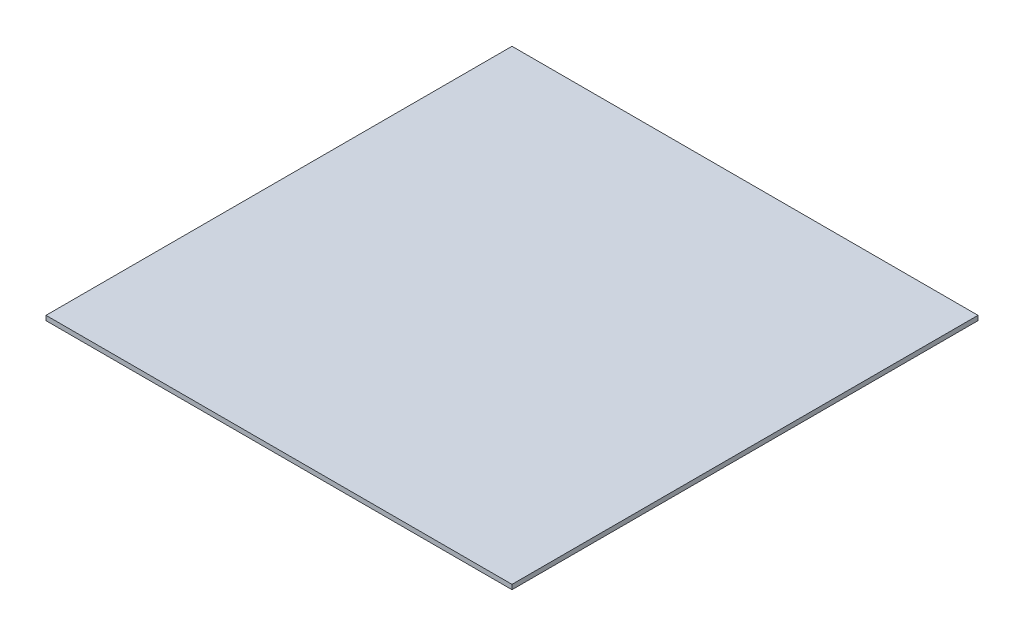
ISO-10303-21;
HEADER;
FILE_DESCRIPTION(('STEP AP214'),'2;1');
FILE_NAME('part.step','',(''),(''),'','','');
FILE_SCHEMA(('AUTOMOTIVE_DESIGN { 1 0 10303 214 1 1 1 1 }'));
ENDSEC;
DATA;
#1=APPLICATION_CONTEXT('core data for automotive mechanical design processes');
#2=APPLICATION_PROTOCOL_DEFINITION('international standard','automotive_design',2000,#1);
#3=PRODUCT_CONTEXT('',#1,'mechanical');
#4=PRODUCT('Part','Part','',(#3));
#5=PRODUCT_RELATED_PRODUCT_CATEGORY('part','',(#4));
#6=PRODUCT_DEFINITION_FORMATION('','',#4);
#7=PRODUCT_DEFINITION_CONTEXT('part definition',#1,'design');
#8=PRODUCT_DEFINITION('design','',#6,#7);
#9=PRODUCT_DEFINITION_SHAPE('','',#8);
#10=(LENGTH_UNIT() NAMED_UNIT(*) SI_UNIT(.MILLI.,.METRE.));
#11=(NAMED_UNIT(*) PLANE_ANGLE_UNIT() SI_UNIT($,.RADIAN.));
#12=(NAMED_UNIT(*) SI_UNIT($,.STERADIAN.) SOLID_ANGLE_UNIT());
#13=UNCERTAINTY_MEASURE_WITH_UNIT(LENGTH_MEASURE(1.E-05),#10,'distance_accuracy_value','');
#14=(GEOMETRIC_REPRESENTATION_CONTEXT(3) GLOBAL_UNCERTAINTY_ASSIGNED_CONTEXT((#13)) GLOBAL_UNIT_ASSIGNED_CONTEXT((#10,
#11,#12)) REPRESENTATION_CONTEXT('',''));
#15=CARTESIAN_POINT('',(0.,0.,0.));
#16=DIRECTION('',(0.,0.,1.));
#17=DIRECTION('',(1.,0.,0.));
#18=AXIS2_PLACEMENT_3D('',#15,#16,#17);
#19=CARTESIAN_POINT('',(-193.816556055352,2.,-50.20326159611));
#20=DIRECTION('',(1.,0.,0.));
#21=DIRECTION('',(0.,0.,-1.));
#22=AXIS2_PLACEMENT_3D('',#19,#20,#21);
#23=PLANE('',#22);
#24=DIRECTION('',(0.,0.,1.));
#25=VECTOR('',#24,1.);
#26=CARTESIAN_POINT('',(-193.816556055352,0.,-50.20326159611));
#27=LINE('',#26,#25);
#28=CARTESIAN_POINT('',(-193.816556055352,0.,-50.20326159611));
#29=VERTEX_POINT('',#28);
#30=CARTESIAN_POINT('',(-193.816556055352,0.,149.79673840389));
#31=VERTEX_POINT('',#30);
#32=EDGE_CURVE('E107',#29,#31,#27,.T.);
#33=ORIENTED_EDGE('',*,*,#32,.T.);
#34=DIRECTION('',(0.,-1.,0.));
#35=VECTOR('',#34,1.);
#36=CARTESIAN_POINT('',(-193.816556055352,2.,149.79673840389));
#37=LINE('',#36,#35);
#38=CARTESIAN_POINT('',(-193.816556055352,2.,149.79673840389));
#39=VERTEX_POINT('',#38);
#40=EDGE_CURVE('E11',#39,#31,#37,.T.);
#41=ORIENTED_EDGE('',*,*,#40,.F.);
#42=DIRECTION('',(0.,0.,1.));
#43=VECTOR('',#42,1.);
#44=CARTESIAN_POINT('',(-193.816556055352,2.,-50.20326159611));
#45=LINE('',#44,#43);
#46=CARTESIAN_POINT('',(-193.816556055352,2.,-50.20326159611));
#47=VERTEX_POINT('',#46);
#48=EDGE_CURVE('E91',#47,#39,#45,.T.);
#49=ORIENTED_EDGE('',*,*,#48,.F.);
#50=DIRECTION('',(0.,-1.,0.));
#51=VECTOR('',#50,1.);
#52=CARTESIAN_POINT('',(-193.816556055352,2.,-50.20326159611));
#53=LINE('',#52,#51);
#54=EDGE_CURVE('E103',#47,#29,#53,.T.);
#55=ORIENTED_EDGE('',*,*,#54,.T.);
#56=EDGE_LOOP('',(#33,#41,#49,#55));
#57=FACE_BOUND('',#56,.T.);
#58=ADVANCED_FACE('F39',(#57),#23,.F.);
#59=CARTESIAN_POINT('',(-193.816556055352,2.,149.79673840389));
#60=DIRECTION('',(0.,0.,-1.));
#61=DIRECTION('',(-1.,0.,0.));
#62=AXIS2_PLACEMENT_3D('',#59,#60,#61);
#63=PLANE('',#62);
#64=DIRECTION('',(1.,0.,0.));
#65=VECTOR('',#64,1.);
#66=CARTESIAN_POINT('',(-193.816556055352,0.,149.79673840389));
#67=LINE('',#66,#65);
#68=CARTESIAN_POINT('',(6.18344394464807,0.,149.79673840389));
#69=VERTEX_POINT('',#68);
#70=EDGE_CURVE('E96',#31,#69,#67,.T.);
#71=ORIENTED_EDGE('',*,*,#70,.T.);
#72=DIRECTION('',(0.,-1.,0.));
#73=VECTOR('',#72,1.);
#74=CARTESIAN_POINT('',(6.18344394464807,2.,149.79673840389));
#75=LINE('',#74,#73);
#76=CARTESIAN_POINT('',(6.18344394464807,2.,149.79673840389));
#77=VERTEX_POINT('',#76);
#78=EDGE_CURVE('E48',#77,#69,#75,.T.);
#79=ORIENTED_EDGE('',*,*,#78,.F.);
#80=DIRECTION('',(1.,0.,0.));
#81=VECTOR('',#80,1.);
#82=CARTESIAN_POINT('',(-193.816556055352,2.,149.79673840389));
#83=LINE('',#82,#81);
#84=EDGE_CURVE('E86',#39,#77,#83,.T.);
#85=ORIENTED_EDGE('',*,*,#84,.F.);
#86=ORIENTED_EDGE('',*,*,#40,.T.);
#87=EDGE_LOOP('',(#71,#79,#85,#86));
#88=FACE_BOUND('',#87,.T.);
#89=ADVANCED_FACE('F95',(#88),#63,.F.);
#90=CARTESIAN_POINT('',(6.18344394464805,2.,-50.20326159611));
#91=DIRECTION('',(-1.,0.,0.));
#92=DIRECTION('',(0.,0.,1.));
#93=AXIS2_PLACEMENT_3D('',#90,#91,#92);
#94=PLANE('',#93);
#95=DIRECTION('',(0.,0.,-1.));
#96=VECTOR('',#95,1.);
#97=CARTESIAN_POINT('',(6.18344394464805,0.,-50.20326159611));
#98=LINE('',#97,#96);
#99=CARTESIAN_POINT('',(6.18344394464805,0.,-50.20326159611));
#100=VERTEX_POINT('',#99);
#101=EDGE_CURVE('E73',#69,#100,#98,.T.);
#102=ORIENTED_EDGE('',*,*,#101,.T.);
#103=DIRECTION('',(0.,-1.,0.));
#104=VECTOR('',#103,1.);
#105=CARTESIAN_POINT('',(6.18344394464805,2.,-50.20326159611));
#106=LINE('',#105,#104);
#107=CARTESIAN_POINT('',(6.18344394464805,2.,-50.20326159611));
#108=VERTEX_POINT('',#107);
#109=EDGE_CURVE('E98',#108,#100,#106,.T.);
#110=ORIENTED_EDGE('',*,*,#109,.F.);
#111=DIRECTION('',(0.,0.,-1.));
#112=VECTOR('',#111,1.);
#113=CARTESIAN_POINT('',(6.18344394464805,2.,-50.20326159611));
#114=LINE('',#113,#112);
#115=EDGE_CURVE('E89',#77,#108,#114,.T.);
#116=ORIENTED_EDGE('',*,*,#115,.F.);
#117=ORIENTED_EDGE('',*,*,#78,.T.);
#118=EDGE_LOOP('',(#102,#110,#116,#117));
#119=FACE_BOUND('',#118,.T.);
#120=ADVANCED_FACE('F99',(#119),#94,.F.);
#121=CARTESIAN_POINT('',(-193.816556055352,2.,-50.20326159611));
#122=DIRECTION('',(0.,0.,1.));
#123=DIRECTION('',(1.,0.,0.));
#124=AXIS2_PLACEMENT_3D('',#121,#122,#123);
#125=PLANE('',#124);
#126=DIRECTION('',(-1.,0.,0.));
#127=VECTOR('',#126,1.);
#128=CARTESIAN_POINT('',(-193.816556055352,0.,-50.20326159611));
#129=LINE('',#128,#127);
#130=EDGE_CURVE('E79',#100,#29,#129,.T.);
#131=ORIENTED_EDGE('',*,*,#130,.T.);
#132=ORIENTED_EDGE('',*,*,#54,.F.);
#133=DIRECTION('',(-1.,0.,0.));
#134=VECTOR('',#133,1.);
#135=CARTESIAN_POINT('',(-193.816556055352,2.,-50.20326159611));
#136=LINE('',#135,#134);
#137=EDGE_CURVE('E56',#108,#47,#136,.T.);
#138=ORIENTED_EDGE('',*,*,#137,.F.);
#139=ORIENTED_EDGE('',*,*,#109,.T.);
#140=EDGE_LOOP('',(#131,#132,#138,#139));
#141=FACE_BOUND('',#140,.T.);
#142=ADVANCED_FACE('F120',(#141),#125,.F.);
#143=CARTESIAN_POINT('',(0.,2.,0.));
#144=DIRECTION('',(0.,1.,0.));
#145=DIRECTION('',(0.,0.,1.));
#146=AXIS2_PLACEMENT_3D('',#143,#144,#145);
#147=PLANE('',#146);
#148=ORIENTED_EDGE('',*,*,#48,.T.);
#149=ORIENTED_EDGE('',*,*,#84,.T.);
#150=ORIENTED_EDGE('',*,*,#115,.T.);
#151=ORIENTED_EDGE('',*,*,#137,.T.);
#152=EDGE_LOOP('',(#148,#149,#150,#151));
#153=FACE_BOUND('',#152,.T.);
#154=ADVANCED_FACE('F87',(#153),#147,.T.);
#155=CARTESIAN_POINT('',(0.,0.,0.));
#156=DIRECTION('',(0.,1.,0.));
#157=DIRECTION('',(0.,0.,1.));
#158=AXIS2_PLACEMENT_3D('',#155,#156,#157);
#159=PLANE('',#158);
#160=ORIENTED_EDGE('',*,*,#32,.F.);
#161=ORIENTED_EDGE('',*,*,#130,.F.);
#162=ORIENTED_EDGE('',*,*,#101,.F.);
#163=ORIENTED_EDGE('',*,*,#70,.F.);
#164=EDGE_LOOP('',(#160,#161,#162,#163));
#165=FACE_BOUND('',#164,.T.);
#166=ADVANCED_FACE('F123',(#165),#159,.F.);
#167=CLOSED_SHELL('',(#58,#89,#120,#142,#154,#166));
#168=MANIFOLD_SOLID_BREP('B2',#167);
#169=ADVANCED_BREP_SHAPE_REPRESENTATION('',(#18,#168),#14);
#170=SHAPE_DEFINITION_REPRESENTATION(#9,#169);
ENDSEC;
END-ISO-10303-21;
